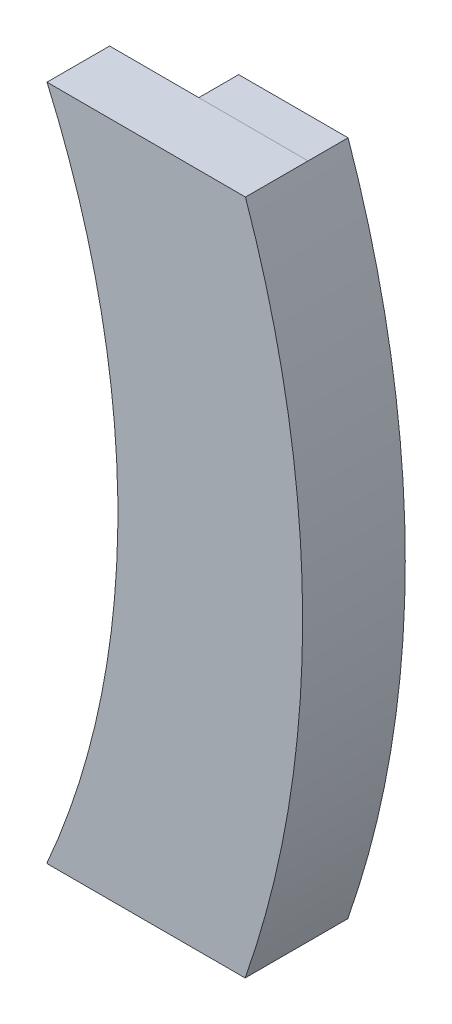
ISO-10303-21;
HEADER;
FILE_DESCRIPTION(('STEP AP214'),'2;1');
FILE_NAME('part.step','',(''),(''),'','','');
FILE_SCHEMA(('AUTOMOTIVE_DESIGN { 1 0 10303 214 1 1 1 1 }'));
ENDSEC;
DATA;
#1=APPLICATION_CONTEXT('core data for automotive mechanical design processes');
#2=APPLICATION_PROTOCOL_DEFINITION('international standard','automotive_design',2000,#1);
#3=PRODUCT_CONTEXT('',#1,'mechanical');
#4=PRODUCT('Part','Part','',(#3));
#5=PRODUCT_RELATED_PRODUCT_CATEGORY('part','',(#4));
#6=PRODUCT_DEFINITION_FORMATION('','',#4);
#7=PRODUCT_DEFINITION_CONTEXT('part definition',#1,'design');
#8=PRODUCT_DEFINITION('design','',#6,#7);
#9=PRODUCT_DEFINITION_SHAPE('','',#8);
#10=(LENGTH_UNIT() NAMED_UNIT(*) SI_UNIT(.MILLI.,.METRE.));
#11=(NAMED_UNIT(*) PLANE_ANGLE_UNIT() SI_UNIT($,.RADIAN.));
#12=(NAMED_UNIT(*) SI_UNIT($,.STERADIAN.) SOLID_ANGLE_UNIT());
#13=UNCERTAINTY_MEASURE_WITH_UNIT(LENGTH_MEASURE(1.E-05),#10,'distance_accuracy_value','');
#14=(GEOMETRIC_REPRESENTATION_CONTEXT(3) GLOBAL_UNCERTAINTY_ASSIGNED_CONTEXT((#13)) GLOBAL_UNIT_ASSIGNED_CONTEXT((#10,
#11,#12)) REPRESENTATION_CONTEXT('',''));
#15=CARTESIAN_POINT('',(0.,0.,0.));
#16=DIRECTION('',(0.,0.,1.));
#17=DIRECTION('',(1.,0.,0.));
#18=AXIS2_PLACEMENT_3D('',#15,#16,#17);
#19=CARTESIAN_POINT('',(-16.4555308979155,-16.5,70.05));
#20=DIRECTION('',(0.,0.,1.));
#21=DIRECTION('',(1.,0.,0.));
#22=AXIS2_PLACEMENT_3D('',#19,#20,#21);
#23=PLANE('',#22);
#24=DIRECTION('',(1.,0.,0.));
#25=VECTOR('',#24,1.);
#26=CARTESIAN_POINT('',(0.,-16.4999999999981,70.05));
#27=LINE('',#26,#25);
#28=CARTESIAN_POINT('',(41.8658572108593,-16.4999999999981,70.05));
#29=VERTEX_POINT('',#28);
#30=CARTESIAN_POINT('',(47.1990466005416,-16.4999999999969,70.05));
#31=VERTEX_POINT('',#30);
#32=EDGE_CURVE('E141',#29,#31,#27,.T.);
#33=ORIENTED_EDGE('',*,*,#32,.F.);
#34=CARTESIAN_POINT('',(0.,0.,70.05));
#35=DIRECTION('',(0.,0.,1.));
#36=DIRECTION('',(1.,0.,0.));
#37=AXIS2_PLACEMENT_3D('',#34,#35,#36);
#38=CIRCLE('',#37,45.);
#39=CARTESIAN_POINT('',(41.88335591697,16.4555308979205,70.05));
#40=VERTEX_POINT('',#39);
#41=EDGE_CURVE('E109',#29,#40,#38,.T.);
#42=ORIENTED_EDGE('',*,*,#41,.T.);
#43=DIRECTION('',(1.,0.,0.));
#44=VECTOR('',#43,1.);
#45=CARTESIAN_POINT('',(0.,16.4555308979205,70.05));
#46=LINE('',#45,#44);
#47=CARTESIAN_POINT('',(47.2145687565563,16.4555308979205,70.05));
#48=VERTEX_POINT('',#47);
#49=EDGE_CURVE('E38',#40,#48,#46,.T.);
#50=ORIENTED_EDGE('',*,*,#49,.T.);
#51=CARTESIAN_POINT('',(0.,0.,70.05));
#52=DIRECTION('',(0.,0.,1.));
#53=DIRECTION('',(1.,0.,0.));
#54=AXIS2_PLACEMENT_3D('',#51,#52,#53);
#55=CIRCLE('',#54,50.);
#56=EDGE_CURVE('E99',#31,#48,#55,.T.);
#57=ORIENTED_EDGE('',*,*,#56,.F.);
#58=EDGE_LOOP('',(#33,#42,#50,#57));
#59=FACE_BOUND('',#58,.T.);
#60=ADVANCED_FACE('F34',(#59),#23,.F.);
#61=CARTESIAN_POINT('',(37.5466905539092,16.4695485198893,72.));
#62=DIRECTION('',(0.00144991558030956,0.999998948871853,0.));
#63=DIRECTION('',(-0.999998948871853,0.00144991558030956,0.));
#64=AXIS2_PLACEMENT_3D('',#61,#62,#63);
#65=PLANE('',#64);
#66=DIRECTION('',(-0.999998948871853,0.00144991558030956,0.));
#67=VECTOR('',#66,1.);
#68=CARTESIAN_POINT('',(37.5466905539092,16.4695485198893,75.05));
#69=LINE('',#68,#67);
#70=CARTESIAN_POINT('',(47.2145687565563,16.4555308979205,75.05));
#71=VERTEX_POINT('',#70);
#72=CARTESIAN_POINT('',(37.5466905539092,16.4695485198893,75.05));
#73=VERTEX_POINT('',#72);
#74=EDGE_CURVE('E11',#71,#73,#69,.T.);
#75=ORIENTED_EDGE('',*,*,#74,.F.);
#76=DIRECTION('',(0.,0.,-1.));
#77=VECTOR('',#76,1.);
#78=CARTESIAN_POINT('',(47.2145687565563,16.4555308979205,75.05));
#79=LINE('',#78,#77);
#80=CARTESIAN_POINT('',(47.2145687565563,16.4555308979205,72.));
#81=VERTEX_POINT('',#80);
#82=EDGE_CURVE('E69',#71,#81,#79,.T.);
#83=ORIENTED_EDGE('',*,*,#82,.T.);
#84=DIRECTION('',(-0.999998948871853,0.00144991558030956,0.));
#85=VECTOR('',#84,1.);
#86=CARTESIAN_POINT('',(37.5466905539092,16.4695485198893,72.));
#87=LINE('',#86,#85);
#88=CARTESIAN_POINT('',(37.5466905539092,16.4695485198893,72.));
#89=VERTEX_POINT('',#88);
#90=EDGE_CURVE('E134',#81,#89,#87,.T.);
#91=ORIENTED_EDGE('',*,*,#90,.T.);
#92=DIRECTION('',(0.,0.,1.));
#93=VECTOR('',#92,1.);
#94=CARTESIAN_POINT('',(37.5466905539092,16.4695485198893,72.));
#95=LINE('',#94,#93);
#96=EDGE_CURVE('E65',#89,#73,#95,.T.);
#97=ORIENTED_EDGE('',*,*,#96,.T.);
#98=EDGE_LOOP('',(#75,#83,#91,#97));
#99=FACE_BOUND('',#98,.T.);
#100=ADVANCED_FACE('F152',(#99),#65,.T.);
#101=CARTESIAN_POINT('',(0.,0.,65.05));
#102=DIRECTION('',(0.,0.,-1.));
#103=DIRECTION('',(-1.,0.,0.));
#104=AXIS2_PLACEMENT_3D('',#101,#102,#103);
#105=CYLINDRICAL_SURFACE('',#104,50.);
#106=DIRECTION('',(0.,0.,-1.));
#107=VECTOR('',#106,1.);
#108=CARTESIAN_POINT('',(47.1990466005416,-16.4999999999969,75.05));
#109=LINE('',#108,#107);
#110=CARTESIAN_POINT('',(47.1990466005416,-16.4999999999969,75.05));
#111=VERTEX_POINT('',#110);
#112=EDGE_CURVE('E104',#111,#31,#109,.T.);
#113=ORIENTED_EDGE('',*,*,#112,.T.);
#114=ORIENTED_EDGE('',*,*,#56,.T.);
#115=EDGE_CURVE('E102',#81,#48,#79,.T.);
#116=ORIENTED_EDGE('',*,*,#115,.F.);
#117=ORIENTED_EDGE('',*,*,#82,.F.);
#118=CARTESIAN_POINT('',(0.,0.,75.05));
#119=DIRECTION('',(0.,0.,1.));
#120=DIRECTION('',(1.,0.,0.));
#121=AXIS2_PLACEMENT_3D('',#118,#119,#120);
#122=CIRCLE('',#121,50.);
#123=EDGE_CURVE('E119',#111,#71,#122,.T.);
#124=ORIENTED_EDGE('',*,*,#123,.F.);
#125=EDGE_LOOP('',(#113,#114,#116,#117,#124));
#126=FACE_BOUND('',#125,.T.);
#127=ADVANCED_FACE('F36',(#126),#105,.T.);
#128=CARTESIAN_POINT('',(0.,0.,65.05));
#129=DIRECTION('',(0.,0.,-1.));
#130=DIRECTION('',(-1.,0.,0.));
#131=AXIS2_PLACEMENT_3D('',#128,#129,#130);
#132=CYLINDRICAL_SURFACE('',#131,45.);
#133=ORIENTED_EDGE('',*,*,#41,.F.);
#134=DIRECTION('',(0.,0.,-1.));
#135=VECTOR('',#134,1.);
#136=CARTESIAN_POINT('',(41.8658572108593,-16.4999999999981,75.05));
#137=LINE('',#136,#135);
#138=CARTESIAN_POINT('',(41.8658572108593,-16.4999999999971,72.));
#139=VERTEX_POINT('',#138);
#140=EDGE_CURVE('E142',#139,#29,#137,.T.);
#141=ORIENTED_EDGE('',*,*,#140,.F.);
#142=CARTESIAN_POINT('',(0.,0.,72.));
#143=DIRECTION('',(0.,0.,1.));
#144=DIRECTION('',(1.,0.,0.));
#145=AXIS2_PLACEMENT_3D('',#142,#143,#144);
#146=CIRCLE('',#145,45.);
#147=CARTESIAN_POINT('',(41.88335591697,16.4555308979205,72.));
#148=VERTEX_POINT('',#147);
#149=EDGE_CURVE('E126',#139,#148,#146,.T.);
#150=ORIENTED_EDGE('',*,*,#149,.T.);
#151=DIRECTION('',(0.,0.,-1.));
#152=VECTOR('',#151,1.);
#153=CARTESIAN_POINT('',(41.88335591697,16.4555308979205,75.05));
#154=LINE('',#153,#152);
#155=EDGE_CURVE('E117',#148,#40,#154,.T.);
#156=ORIENTED_EDGE('',*,*,#155,.T.);
#157=EDGE_LOOP('',(#133,#141,#150,#156));
#158=FACE_BOUND('',#157,.T.);
#159=ADVANCED_FACE('F150',(#158),#132,.F.);
#160=CARTESIAN_POINT('',(0.,0.,72.));
#161=DIRECTION('',(0.,0.,1.));
#162=DIRECTION('',(1.,0.,0.));
#163=AXIS2_PLACEMENT_3D('',#160,#161,#162);
#164=PLANE('',#163);
#165=ORIENTED_EDGE('',*,*,#149,.F.);
#166=DIRECTION('',(1.,0.,0.));
#167=VECTOR('',#166,1.);
#168=CARTESIAN_POINT('',(47.1990466005416,-16.4999999999969,72.));
#169=LINE('',#168,#167);
#170=CARTESIAN_POINT('',(37.5333185316738,-16.4999999999973,72.));
#171=VERTEX_POINT('',#170);
#172=EDGE_CURVE('E131',#171,#139,#169,.T.);
#173=ORIENTED_EDGE('',*,*,#172,.F.);
#174=CARTESIAN_POINT('',(0.,0.,72.));
#175=DIRECTION('',(0.,0.,-1.));
#176=DIRECTION('',(1.,0.,0.));
#177=AXIS2_PLACEMENT_3D('',#174,#175,#176);
#178=CIRCLE('',#177,41.);
#179=EDGE_CURVE('E138',#89,#171,#178,.T.);
#180=ORIENTED_EDGE('',*,*,#179,.F.);
#181=ORIENTED_EDGE('',*,*,#90,.F.);
#182=DIRECTION('',(-1.,0.,0.));
#183=VECTOR('',#182,1.);
#184=CARTESIAN_POINT('',(41.88335591697,16.4555308979205,72.));
#185=LINE('',#184,#183);
#186=EDGE_CURVE('E108',#81,#148,#185,.T.);
#187=ORIENTED_EDGE('',*,*,#186,.T.);
#188=EDGE_LOOP('',(#165,#173,#180,#181,#187));
#189=FACE_BOUND('',#188,.T.);
#190=ADVANCED_FACE('F146',(#189),#164,.F.);
#191=CARTESIAN_POINT('',(0.,0.,72.));
#192=DIRECTION('',(0.,0.,1.));
#193=DIRECTION('',(1.,0.,0.));
#194=AXIS2_PLACEMENT_3D('',#191,#192,#193);
#195=CYLINDRICAL_SURFACE('',#194,41.);
#196=CARTESIAN_POINT('',(0.,0.,75.05));
#197=DIRECTION('',(0.,0.,-1.));
#198=DIRECTION('',(1.,0.,0.));
#199=AXIS2_PLACEMENT_3D('',#196,#197,#198);
#200=CIRCLE('',#199,41.);
#201=CARTESIAN_POINT('',(37.5333185316738,-16.4999999999973,75.05));
#202=VERTEX_POINT('',#201);
#203=EDGE_CURVE('E44',#73,#202,#200,.T.);
#204=ORIENTED_EDGE('',*,*,#203,.F.);
#205=ORIENTED_EDGE('',*,*,#96,.F.);
#206=ORIENTED_EDGE('',*,*,#179,.T.);
#207=DIRECTION('',(0.,0.,1.));
#208=VECTOR('',#207,1.);
#209=CARTESIAN_POINT('',(37.5333185316738,-16.4999999999973,72.));
#210=LINE('',#209,#208);
#211=EDGE_CURVE('E129',#171,#202,#210,.T.);
#212=ORIENTED_EDGE('',*,*,#211,.T.);
#213=EDGE_LOOP('',(#204,#205,#206,#212));
#214=FACE_BOUND('',#213,.T.);
#215=ADVANCED_FACE('F153',(#214),#195,.F.);
#216=CARTESIAN_POINT('',(0.,0.,75.05));
#217=DIRECTION('',(0.,0.,1.));
#218=DIRECTION('',(1.,0.,0.));
#219=AXIS2_PLACEMENT_3D('',#216,#217,#218);
#220=PLANE('',#219);
#221=ORIENTED_EDGE('',*,*,#203,.T.);
#222=DIRECTION('',(1.,2.28339140269732E-13,0.));
#223=VECTOR('',#222,1.);
#224=CARTESIAN_POINT('',(41.8658572108593,-16.4999999999981,75.05));
#225=LINE('',#224,#223);
#226=EDGE_CURVE('E75',#202,#111,#225,.T.);
#227=ORIENTED_EDGE('',*,*,#226,.T.);
#228=ORIENTED_EDGE('',*,*,#123,.T.);
#229=ORIENTED_EDGE('',*,*,#74,.T.);
#230=EDGE_LOOP('',(#221,#227,#228,#229));
#231=FACE_BOUND('',#230,.T.);
#232=ADVANCED_FACE('F155',(#231),#220,.T.);
#233=CARTESIAN_POINT('',(41.8658572108593,-16.4999999999981,75.05));
#234=DIRECTION('',(-2.28339140269732E-13,1.,0.));
#235=DIRECTION('',(-1.,-2.28339140269732E-13,0.));
#236=AXIS2_PLACEMENT_3D('',#233,#234,#235);
#237=PLANE('',#236);
#238=ORIENTED_EDGE('',*,*,#226,.F.);
#239=ORIENTED_EDGE('',*,*,#211,.F.);
#240=ORIENTED_EDGE('',*,*,#172,.T.);
#241=ORIENTED_EDGE('',*,*,#140,.T.);
#242=ORIENTED_EDGE('',*,*,#32,.T.);
#243=ORIENTED_EDGE('',*,*,#112,.F.);
#244=EDGE_LOOP('',(#238,#239,#240,#241,#242,#243));
#245=FACE_BOUND('',#244,.T.);
#246=ADVANCED_FACE('F151',(#245),#237,.F.);
#247=CARTESIAN_POINT('',(41.88335591697,16.4555308979205,75.05));
#248=DIRECTION('',(0.,-1.,0.));
#249=DIRECTION('',(0.,0.,-1.));
#250=AXIS2_PLACEMENT_3D('',#247,#248,#249);
#251=PLANE('',#250);
#252=ORIENTED_EDGE('',*,*,#186,.F.);
#253=ORIENTED_EDGE('',*,*,#115,.T.);
#254=ORIENTED_EDGE('',*,*,#49,.F.);
#255=ORIENTED_EDGE('',*,*,#155,.F.);
#256=EDGE_LOOP('',(#252,#253,#254,#255));
#257=FACE_BOUND('',#256,.T.);
#258=ADVANCED_FACE('F116',(#257),#251,.F.);
#259=CLOSED_SHELL('',(#60,#100,#127,#159,#190,#215,#232,#246,#258));
#260=MANIFOLD_SOLID_BREP('B2',#259);
#261=ADVANCED_BREP_SHAPE_REPRESENTATION('',(#18,#260),#14);
#262=SHAPE_DEFINITION_REPRESENTATION(#9,#261);
ENDSEC;
END-ISO-10303-21;
